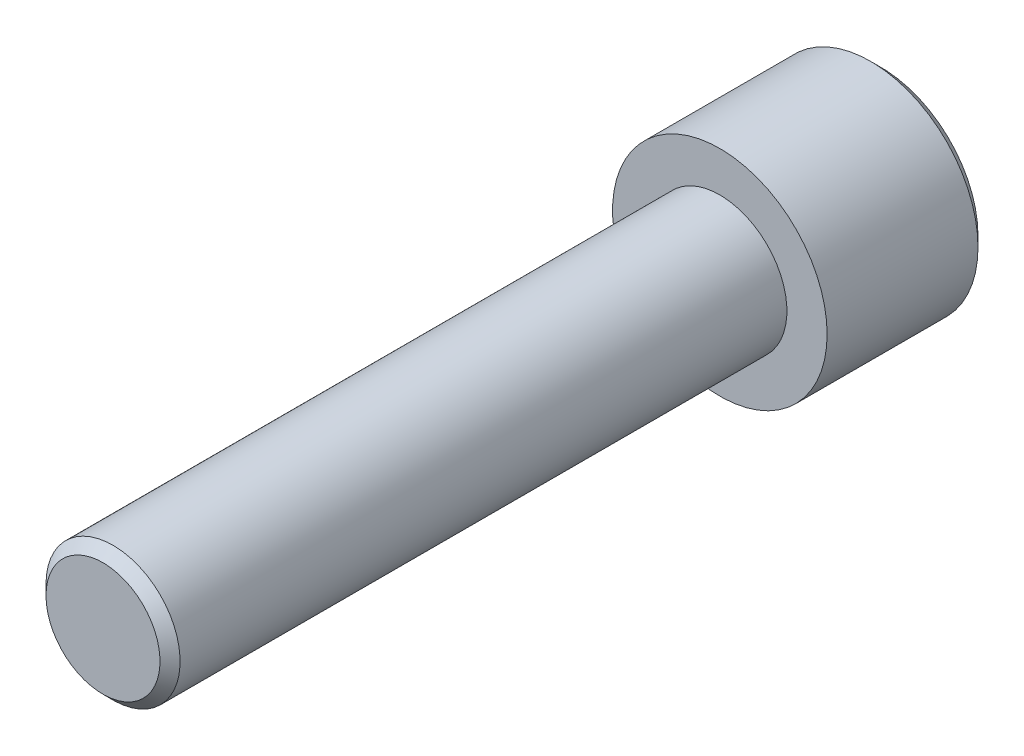
ISO-10303-21;
HEADER;
FILE_DESCRIPTION(('STEP AP214'),'2;1');
FILE_NAME('part.step','',(''),(''),'','','');
FILE_SCHEMA(('AUTOMOTIVE_DESIGN { 1 0 10303 214 1 1 1 1 }'));
ENDSEC;
DATA;
#1=APPLICATION_CONTEXT('core data for automotive mechanical design processes');
#2=APPLICATION_PROTOCOL_DEFINITION('international standard','automotive_design',2000,#1);
#3=PRODUCT_CONTEXT('',#1,'mechanical');
#4=PRODUCT('Part','Part','',(#3));
#5=PRODUCT_RELATED_PRODUCT_CATEGORY('part','',(#4));
#6=PRODUCT_DEFINITION_FORMATION('','',#4);
#7=PRODUCT_DEFINITION_CONTEXT('part definition',#1,'design');
#8=PRODUCT_DEFINITION('design','',#6,#7);
#9=PRODUCT_DEFINITION_SHAPE('','',#8);
#10=(LENGTH_UNIT() NAMED_UNIT(*) SI_UNIT(.MILLI.,.METRE.));
#11=(NAMED_UNIT(*) PLANE_ANGLE_UNIT() SI_UNIT($,.RADIAN.));
#12=(NAMED_UNIT(*) SI_UNIT($,.STERADIAN.) SOLID_ANGLE_UNIT());
#13=UNCERTAINTY_MEASURE_WITH_UNIT(LENGTH_MEASURE(1.E-05),#10,'distance_accuracy_value','');
#14=(GEOMETRIC_REPRESENTATION_CONTEXT(3) GLOBAL_UNCERTAINTY_ASSIGNED_CONTEXT((#13)) GLOBAL_UNIT_ASSIGNED_CONTEXT((#10,
#11,#12)) REPRESENTATION_CONTEXT('',''));
#15=CARTESIAN_POINT('',(0.,0.,0.));
#16=DIRECTION('',(0.,0.,1.));
#17=DIRECTION('',(1.,0.,0.));
#18=AXIS2_PLACEMENT_3D('',#15,#16,#17);
#19=CARTESIAN_POINT('',(-9.33720002000013,-1.47499578,1.7));
#20=DIRECTION('',(0.,0.,1.));
#21=DIRECTION('',(1.,0.,0.));
#22=AXIS2_PLACEMENT_3D('',#19,#20,#21);
#23=PLANE('',#22);
#24=CARTESIAN_POINT('',(-9.33720002000013,-1.47499578,1.69999999997117));
#25=DIRECTION('',(0.,0.,1.));
#26=DIRECTION('',(1.,0.,0.));
#27=AXIS2_PLACEMENT_3D('',#24,#25,#26);
#28=CIRCLE('',#27,0.725000000202675);
#29=CARTESIAN_POINT('',(-8.61220001979746,-1.47499578,1.69999999997117));
#30=VERTEX_POINT('',#29);
#31=EDGE_CURVE('E18',#30,#30,#28,.T.);
#32=ORIENTED_EDGE('',*,*,#31,.F.);
#33=EDGE_LOOP('',(#32));
#34=FACE_BOUND('',#33,.T.);
#35=ADVANCED_FACE('F15',(#34),#23,.F.);
#36=CARTESIAN_POINT('',(-9.33720002000013,-1.47499578,1.77499999995234));
#37=DIRECTION('',(0.,0.,1.));
#38=DIRECTION('',(1.,0.,0.));
#39=AXIS2_PLACEMENT_3D('',#36,#37,#38);
#40=CONICAL_SURFACE('',#39,0.800000000013318,0.78539816226058);
#41=CARTESIAN_POINT('',(-9.33720002000013,-1.47499578,1.775));
#42=DIRECTION('',(0.,0.,1.));
#43=DIRECTION('',(1.,0.,0.));
#44=AXIS2_PLACEMENT_3D('',#41,#42,#43);
#45=CIRCLE('',#44,0.8);
#46=CARTESIAN_POINT('',(-8.53720002000013,-1.47499578,1.775));
#47=VERTEX_POINT('',#46);
#48=EDGE_CURVE('E31',#47,#47,#45,.T.);
#49=ORIENTED_EDGE('',*,*,#48,.F.);
#50=EDGE_LOOP('',(#49));
#51=FACE_BOUND('',#50,.T.);
#52=ORIENTED_EDGE('',*,*,#31,.T.);
#53=EDGE_LOOP('',(#52));
#54=FACE_BOUND('',#53,.T.);
#55=ADVANCED_FACE('F43',(#51,#54),#40,.T.);
#56=CARTESIAN_POINT('',(-9.33720002000013,-1.47499578,7.5));
#57=DIRECTION('',(0.,0.,1.));
#58=DIRECTION('',(1.,0.,0.));
#59=AXIS2_PLACEMENT_3D('',#56,#57,#58);
#60=PLANE('',#59);
#61=CARTESIAN_POINT('',(-9.33720002000013,-1.47499578,7.49999999999318));
#62=DIRECTION('',(0.,0.,-1.));
#63=DIRECTION('',(-1.,0.,0.));
#64=AXIS2_PLACEMENT_3D('',#61,#62,#63);
#65=CIRCLE('',#64,0.425000000020242);
#66=CARTESIAN_POINT('',(-9.76220002002037,-1.47499578,7.49999999999318));
#67=VERTEX_POINT('',#66);
#68=EDGE_CURVE('E33',#67,#67,#65,.T.);
#69=ORIENTED_EDGE('',*,*,#68,.F.);
#70=EDGE_LOOP('',(#69));
#71=FACE_BOUND('',#70,.T.);
#72=ADVANCED_FACE('F50',(#71),#60,.T.);
#73=CARTESIAN_POINT('',(-9.33720002000013,-1.47499578,1.7));
#74=DIRECTION('',(0.,0.,1.));
#75=DIRECTION('',(1.,0.,0.));
#76=AXIS2_PLACEMENT_3D('',#73,#74,#75);
#77=CYLINDRICAL_SURFACE('',#76,0.8);
#78=CARTESIAN_POINT('',(-9.33720002000013,-1.47499578,2.9));
#79=DIRECTION('',(0.,0.,1.));
#80=DIRECTION('',(1.,0.,0.));
#81=AXIS2_PLACEMENT_3D('',#78,#79,#80);
#82=CIRCLE('',#81,0.8);
#83=CARTESIAN_POINT('',(-8.53720002000013,-1.47499578,2.9));
#84=VERTEX_POINT('',#83);
#85=EDGE_CURVE('E27',#84,#84,#82,.T.);
#86=ORIENTED_EDGE('',*,*,#85,.F.);
#87=EDGE_LOOP('',(#86));
#88=FACE_BOUND('',#87,.T.);
#89=ORIENTED_EDGE('',*,*,#48,.T.);
#90=EDGE_LOOP('',(#89));
#91=FACE_BOUND('',#90,.T.);
#92=ADVANCED_FACE('F66',(#88,#91),#77,.T.);
#93=CARTESIAN_POINT('',(-9.33720002000013,-1.47499578,7.42499999995516));
#94=DIRECTION('',(0.,0.,-1.));
#95=DIRECTION('',(-1.,0.,0.));
#96=AXIS2_PLACEMENT_3D('',#93,#94,#95);
#97=CONICAL_SURFACE('',#96,0.499999999944573,0.785398162639542);
#98=ORIENTED_EDGE('',*,*,#68,.T.);
#99=EDGE_LOOP('',(#98));
#100=FACE_BOUND('',#99,.T.);
#101=CARTESIAN_POINT('',(-9.33720002000013,-1.47499578,7.425));
#102=DIRECTION('',(0.,0.,-1.));
#103=DIRECTION('',(-1.,0.,0.));
#104=AXIS2_PLACEMENT_3D('',#101,#102,#103);
#105=CIRCLE('',#104,0.5);
#106=CARTESIAN_POINT('',(-9.83720002000013,-1.47499578,7.425));
#107=VERTEX_POINT('',#106);
#108=EDGE_CURVE('E22',#107,#107,#105,.T.);
#109=ORIENTED_EDGE('',*,*,#108,.F.);
#110=EDGE_LOOP('',(#109));
#111=FACE_BOUND('',#110,.T.);
#112=ADVANCED_FACE('F60',(#100,#111),#97,.T.);
#113=CARTESIAN_POINT('',(-9.33720002000013,-1.47499578,2.9));
#114=DIRECTION('',(0.,0.,1.));
#115=DIRECTION('',(1.,0.,0.));
#116=AXIS2_PLACEMENT_3D('',#113,#114,#115);
#117=PLANE('',#116);
#118=CARTESIAN_POINT('',(-9.33720002000013,-1.47499578,2.9));
#119=DIRECTION('',(0.,0.,-1.));
#120=DIRECTION('',(-1.,0.,0.));
#121=AXIS2_PLACEMENT_3D('',#118,#119,#120);
#122=CIRCLE('',#121,0.5);
#123=CARTESIAN_POINT('',(-9.83720002000013,-1.47499578,2.9));
#124=VERTEX_POINT('',#123);
#125=EDGE_CURVE('E10',#124,#124,#122,.F.);
#126=ORIENTED_EDGE('',*,*,#125,.F.);
#127=EDGE_LOOP('',(#126));
#128=FACE_BOUND('',#127,.T.);
#129=ORIENTED_EDGE('',*,*,#85,.T.);
#130=EDGE_LOOP('',(#129));
#131=FACE_BOUND('',#130,.T.);
#132=ADVANCED_FACE('F54',(#128,#131),#117,.T.);
#133=CARTESIAN_POINT('',(-9.33720002000013,-1.47499578,7.5));
#134=DIRECTION('',(0.,0.,-1.));
#135=DIRECTION('',(-1.,0.,0.));
#136=AXIS2_PLACEMENT_3D('',#133,#134,#135);
#137=CYLINDRICAL_SURFACE('',#136,0.5);
#138=ORIENTED_EDGE('',*,*,#108,.T.);
#139=EDGE_LOOP('',(#138));
#140=FACE_BOUND('',#139,.T.);
#141=ORIENTED_EDGE('',*,*,#125,.T.);
#142=EDGE_LOOP('',(#141));
#143=FACE_BOUND('',#142,.T.);
#144=ADVANCED_FACE('F52',(#140,#143),#137,.T.);
#145=CLOSED_SHELL('',(#35,#55,#72,#92,#112,#132,#144));
#146=MANIFOLD_SOLID_BREP('B1',#145);
#147=ADVANCED_BREP_SHAPE_REPRESENTATION('',(#18,#146),#14);
#148=SHAPE_DEFINITION_REPRESENTATION(#9,#147);
ENDSEC;
END-ISO-10303-21;
